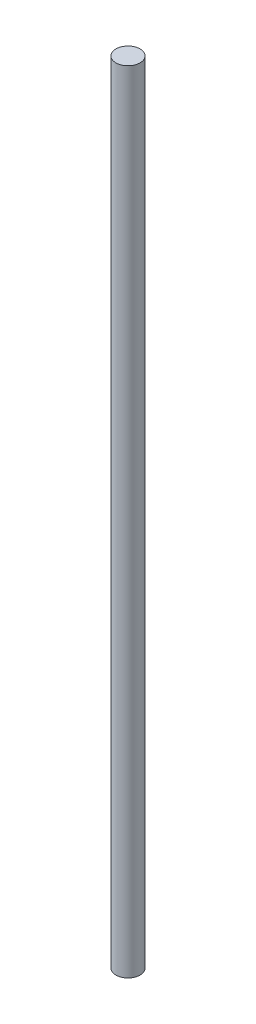
ISO-10303-21;
HEADER;
FILE_DESCRIPTION(('STEP AP214'),'2;1');
FILE_NAME('part.step','',(''),(''),'','','');
FILE_SCHEMA(('AUTOMOTIVE_DESIGN { 1 0 10303 214 1 1 1 1 }'));
ENDSEC;
DATA;
#1=APPLICATION_CONTEXT('core data for automotive mechanical design processes');
#2=APPLICATION_PROTOCOL_DEFINITION('international standard','automotive_design',2000,#1);
#3=PRODUCT_CONTEXT('',#1,'mechanical');
#4=PRODUCT('Part','Part','',(#3));
#5=PRODUCT_RELATED_PRODUCT_CATEGORY('part','',(#4));
#6=PRODUCT_DEFINITION_FORMATION('','',#4);
#7=PRODUCT_DEFINITION_CONTEXT('part definition',#1,'design');
#8=PRODUCT_DEFINITION('design','',#6,#7);
#9=PRODUCT_DEFINITION_SHAPE('','',#8);
#10=(LENGTH_UNIT() NAMED_UNIT(*) SI_UNIT(.MILLI.,.METRE.));
#11=(NAMED_UNIT(*) PLANE_ANGLE_UNIT() SI_UNIT($,.RADIAN.));
#12=(NAMED_UNIT(*) SI_UNIT($,.STERADIAN.) SOLID_ANGLE_UNIT());
#13=UNCERTAINTY_MEASURE_WITH_UNIT(LENGTH_MEASURE(1.E-05),#10,'distance_accuracy_value','');
#14=(GEOMETRIC_REPRESENTATION_CONTEXT(3) GLOBAL_UNCERTAINTY_ASSIGNED_CONTEXT((#13)) GLOBAL_UNIT_ASSIGNED_CONTEXT((#10,
#11,#12)) REPRESENTATION_CONTEXT('',''));
#15=CARTESIAN_POINT('',(0.,0.,0.));
#16=DIRECTION('',(0.,0.,1.));
#17=DIRECTION('',(1.,0.,0.));
#18=AXIS2_PLACEMENT_3D('',#15,#16,#17);
#19=CARTESIAN_POINT('',(0.,196.,0.));
#20=DIRECTION('',(0.,-1.,0.));
#21=DIRECTION('',(0.,0.,-1.));
#22=AXIS2_PLACEMENT_3D('',#19,#20,#21);
#23=CYLINDRICAL_SURFACE('',#22,3.);
#24=CARTESIAN_POINT('',(0.,196.,0.));
#25=DIRECTION('',(0.,1.,0.));
#26=DIRECTION('',(0.,0.,1.));
#27=AXIS2_PLACEMENT_3D('',#24,#25,#26);
#28=CIRCLE('',#27,3.);
#29=CARTESIAN_POINT('',(0.,196.,3.));
#30=VERTEX_POINT('',#29);
#31=EDGE_CURVE('E10',#30,#30,#28,.T.);
#32=ORIENTED_EDGE('',*,*,#31,.F.);
#33=EDGE_LOOP('',(#32));
#34=FACE_BOUND('',#33,.T.);
#35=CARTESIAN_POINT('',(0.,0.,0.));
#36=DIRECTION('',(0.,1.,0.));
#37=DIRECTION('',(0.,0.,1.));
#38=AXIS2_PLACEMENT_3D('',#35,#36,#37);
#39=CIRCLE('',#38,3.);
#40=CARTESIAN_POINT('',(0.,0.,3.));
#41=VERTEX_POINT('',#40);
#42=EDGE_CURVE('E34',#41,#41,#39,.T.);
#43=ORIENTED_EDGE('',*,*,#42,.T.);
#44=EDGE_LOOP('',(#43));
#45=FACE_BOUND('',#44,.T.);
#46=ADVANCED_FACE('F31',(#34,#45),#23,.T.);
#47=CARTESIAN_POINT('',(0.,196.,0.));
#48=DIRECTION('',(0.,1.,0.));
#49=DIRECTION('',(0.,0.,1.));
#50=AXIS2_PLACEMENT_3D('',#47,#48,#49);
#51=PLANE('',#50);
#52=ORIENTED_EDGE('',*,*,#31,.T.);
#53=EDGE_LOOP('',(#52));
#54=FACE_BOUND('',#53,.T.);
#55=ADVANCED_FACE('F46',(#54),#51,.T.);
#56=CARTESIAN_POINT('',(0.,0.,0.));
#57=DIRECTION('',(0.,1.,0.));
#58=DIRECTION('',(0.,0.,1.));
#59=AXIS2_PLACEMENT_3D('',#56,#57,#58);
#60=PLANE('',#59);
#61=ORIENTED_EDGE('',*,*,#42,.F.);
#62=EDGE_LOOP('',(#61));
#63=FACE_BOUND('',#62,.T.);
#64=ADVANCED_FACE('F44',(#63),#60,.F.);
#65=CLOSED_SHELL('',(#46,#55,#64));
#66=MANIFOLD_SOLID_BREP('B2',#65);
#67=ADVANCED_BREP_SHAPE_REPRESENTATION('',(#18,#66),#14);
#68=SHAPE_DEFINITION_REPRESENTATION(#9,#67);
ENDSEC;
END-ISO-10303-21;
